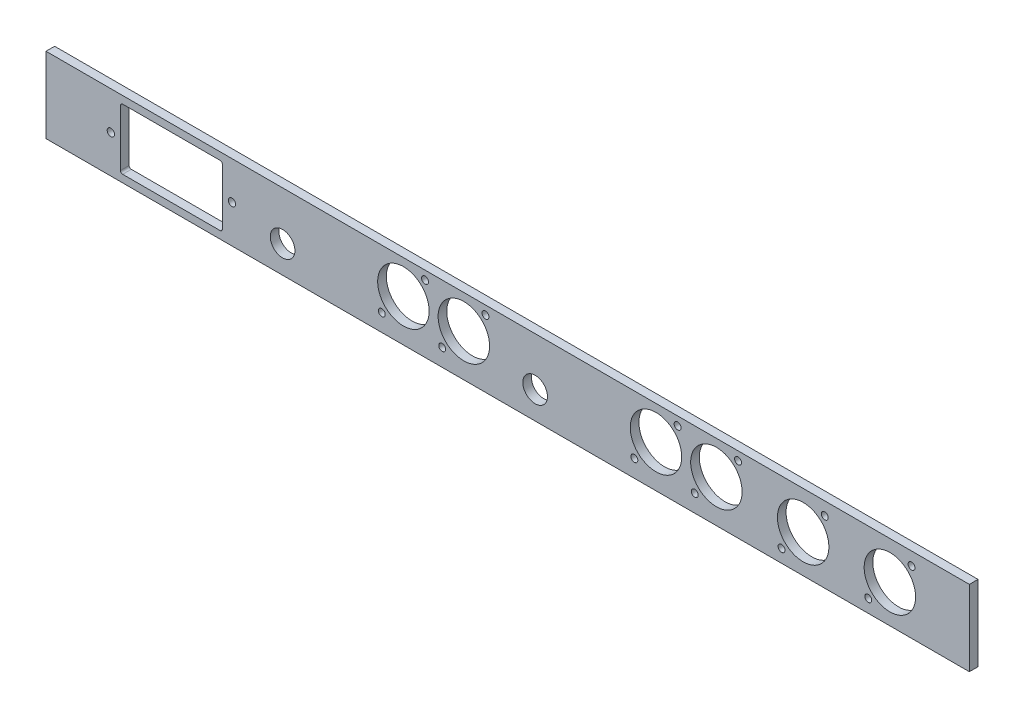
ISO-10303-21;
HEADER;
FILE_DESCRIPTION(('STEP AP214'),'2;1');
FILE_NAME('part.step','',(''),(''),'','','');
FILE_SCHEMA(('AUTOMOTIVE_DESIGN { 1 0 10303 214 1 1 1 1 }'));
ENDSEC;
DATA;
#1=APPLICATION_CONTEXT('core data for automotive mechanical design processes');
#2=APPLICATION_PROTOCOL_DEFINITION('international standard','automotive_design',2000,#1);
#3=PRODUCT_CONTEXT('',#1,'mechanical');
#4=PRODUCT('Part','Part','',(#3));
#5=PRODUCT_RELATED_PRODUCT_CATEGORY('part','',(#4));
#6=PRODUCT_DEFINITION_FORMATION('','',#4);
#7=PRODUCT_DEFINITION_CONTEXT('part definition',#1,'design');
#8=PRODUCT_DEFINITION('design','',#6,#7);
#9=PRODUCT_DEFINITION_SHAPE('','',#8);
#10=(LENGTH_UNIT() NAMED_UNIT(*) SI_UNIT(.MILLI.,.METRE.));
#11=(NAMED_UNIT(*) PLANE_ANGLE_UNIT() SI_UNIT($,.RADIAN.));
#12=(NAMED_UNIT(*) SI_UNIT($,.STERADIAN.) SOLID_ANGLE_UNIT());
#13=UNCERTAINTY_MEASURE_WITH_UNIT(LENGTH_MEASURE(1.E-05),#10,'distance_accuracy_value','');
#14=(GEOMETRIC_REPRESENTATION_CONTEXT(3) GLOBAL_UNCERTAINTY_ASSIGNED_CONTEXT((#13)) GLOBAL_UNIT_ASSIGNED_CONTEXT((#10,
#11,#12)) REPRESENTATION_CONTEXT('',''));
#15=CARTESIAN_POINT('',(0.,0.,0.));
#16=DIRECTION('',(0.,0.,1.));
#17=DIRECTION('',(1.,0.,0.));
#18=AXIS2_PLACEMENT_3D('',#15,#16,#17);
#19=CARTESIAN_POINT('',(-213.5,-17.5,4.));
#20=DIRECTION('',(1.,0.,0.));
#21=DIRECTION('',(0.,0.,-1.));
#22=AXIS2_PLACEMENT_3D('',#19,#20,#21);
#23=PLANE('',#22);
#24=DIRECTION('',(0.,-1.,0.));
#25=VECTOR('',#24,1.);
#26=CARTESIAN_POINT('',(-213.5,-17.5,0.));
#27=LINE('',#26,#25);
#28=CARTESIAN_POINT('',(-213.5,17.5,0.));
#29=VERTEX_POINT('',#28);
#30=CARTESIAN_POINT('',(-213.5,-17.5,0.));
#31=VERTEX_POINT('',#30);
#32=EDGE_CURVE('E294',#29,#31,#27,.T.);
#33=ORIENTED_EDGE('',*,*,#32,.T.);
#34=DIRECTION('',(0.,0.,-1.));
#35=VECTOR('',#34,1.);
#36=CARTESIAN_POINT('',(-213.5,-17.5,4.));
#37=LINE('',#36,#35);
#38=CARTESIAN_POINT('',(-213.5,-17.5,4.));
#39=VERTEX_POINT('',#38);
#40=EDGE_CURVE('E11',#39,#31,#37,.T.);
#41=ORIENTED_EDGE('',*,*,#40,.F.);
#42=DIRECTION('',(0.,-1.,0.));
#43=VECTOR('',#42,1.);
#44=CARTESIAN_POINT('',(-213.5,-17.5,4.));
#45=LINE('',#44,#43);
#46=CARTESIAN_POINT('',(-213.5,17.5,4.));
#47=VERTEX_POINT('',#46);
#48=EDGE_CURVE('E297',#47,#39,#45,.T.);
#49=ORIENTED_EDGE('',*,*,#48,.F.);
#50=DIRECTION('',(0.,0.,-1.));
#51=VECTOR('',#50,1.);
#52=CARTESIAN_POINT('',(-213.5,17.5,4.));
#53=LINE('',#52,#51);
#54=EDGE_CURVE('E307',#47,#29,#53,.T.);
#55=ORIENTED_EDGE('',*,*,#54,.T.);
#56=EDGE_LOOP('',(#33,#41,#49,#55));
#57=FACE_BOUND('',#56,.T.);
#58=ADVANCED_FACE('F38',(#57),#23,.F.);
#59=CARTESIAN_POINT('',(-213.5,-17.5,4.));
#60=DIRECTION('',(0.,1.,0.));
#61=DIRECTION('',(0.,0.,1.));
#62=AXIS2_PLACEMENT_3D('',#59,#60,#61);
#63=PLANE('',#62);
#64=DIRECTION('',(1.,0.,0.));
#65=VECTOR('',#64,1.);
#66=CARTESIAN_POINT('',(-213.5,-17.5,0.));
#67=LINE('',#66,#65);
#68=CARTESIAN_POINT('',(213.5,-17.5,0.));
#69=VERTEX_POINT('',#68);
#70=EDGE_CURVE('E310',#31,#69,#67,.T.);
#71=ORIENTED_EDGE('',*,*,#70,.T.);
#72=DIRECTION('',(0.,0.,-1.));
#73=VECTOR('',#72,1.);
#74=CARTESIAN_POINT('',(213.5,-17.5,4.));
#75=LINE('',#74,#73);
#76=CARTESIAN_POINT('',(213.5,-17.5,4.));
#77=VERTEX_POINT('',#76);
#78=EDGE_CURVE('E45',#77,#69,#75,.T.);
#79=ORIENTED_EDGE('',*,*,#78,.F.);
#80=DIRECTION('',(1.,0.,0.));
#81=VECTOR('',#80,1.);
#82=CARTESIAN_POINT('',(-213.5,-17.5,4.));
#83=LINE('',#82,#81);
#84=EDGE_CURVE('E300',#39,#77,#83,.T.);
#85=ORIENTED_EDGE('',*,*,#84,.F.);
#86=ORIENTED_EDGE('',*,*,#40,.T.);
#87=EDGE_LOOP('',(#71,#79,#85,#86));
#88=FACE_BOUND('',#87,.T.);
#89=ADVANCED_FACE('F339',(#88),#63,.F.);
#90=CARTESIAN_POINT('',(213.5,-17.5,4.));
#91=DIRECTION('',(-1.,0.,0.));
#92=DIRECTION('',(0.,0.,1.));
#93=AXIS2_PLACEMENT_3D('',#90,#91,#92);
#94=PLANE('',#93);
#95=DIRECTION('',(0.,1.,0.));
#96=VECTOR('',#95,1.);
#97=CARTESIAN_POINT('',(213.5,-17.5,0.));
#98=LINE('',#97,#96);
#99=CARTESIAN_POINT('',(213.5,17.5,0.));
#100=VERTEX_POINT('',#99);
#101=EDGE_CURVE('E312',#69,#100,#98,.T.);
#102=ORIENTED_EDGE('',*,*,#101,.T.);
#103=DIRECTION('',(0.,0.,-1.));
#104=VECTOR('',#103,1.);
#105=CARTESIAN_POINT('',(213.5,17.5,4.));
#106=LINE('',#105,#104);
#107=CARTESIAN_POINT('',(213.5,17.5,4.));
#108=VERTEX_POINT('',#107);
#109=EDGE_CURVE('E317',#108,#100,#106,.T.);
#110=ORIENTED_EDGE('',*,*,#109,.F.);
#111=DIRECTION('',(0.,1.,0.));
#112=VECTOR('',#111,1.);
#113=CARTESIAN_POINT('',(213.5,-17.5,4.));
#114=LINE('',#113,#112);
#115=EDGE_CURVE('E303',#77,#108,#114,.T.);
#116=ORIENTED_EDGE('',*,*,#115,.F.);
#117=ORIENTED_EDGE('',*,*,#78,.T.);
#118=EDGE_LOOP('',(#102,#110,#116,#117));
#119=FACE_BOUND('',#118,.T.);
#120=ADVANCED_FACE('F324',(#119),#94,.F.);
#121=CARTESIAN_POINT('',(-213.5,17.5,4.));
#122=DIRECTION('',(0.,-1.,0.));
#123=DIRECTION('',(0.,0.,-1.));
#124=AXIS2_PLACEMENT_3D('',#121,#122,#123);
#125=PLANE('',#124);
#126=DIRECTION('',(-1.,0.,0.));
#127=VECTOR('',#126,1.);
#128=CARTESIAN_POINT('',(-213.5,17.5,0.));
#129=LINE('',#128,#127);
#130=EDGE_CURVE('E301',#100,#29,#129,.T.);
#131=ORIENTED_EDGE('',*,*,#130,.T.);
#132=ORIENTED_EDGE('',*,*,#54,.F.);
#133=DIRECTION('',(-1.,0.,0.));
#134=VECTOR('',#133,1.);
#135=CARTESIAN_POINT('',(-213.5,17.5,4.));
#136=LINE('',#135,#134);
#137=EDGE_CURVE('E305',#108,#47,#136,.T.);
#138=ORIENTED_EDGE('',*,*,#137,.F.);
#139=ORIENTED_EDGE('',*,*,#109,.T.);
#140=EDGE_LOOP('',(#131,#132,#138,#139));
#141=FACE_BOUND('',#140,.T.);
#142=ADVANCED_FACE('F332',(#141),#125,.F.);
#143=CARTESIAN_POINT('',(0.,0.,4.));
#144=DIRECTION('',(0.,0.,-1.));
#145=DIRECTION('',(-1.,0.,0.));
#146=AXIS2_PLACEMENT_3D('',#143,#144,#145);
#147=PLANE('',#146);
#148=CARTESIAN_POINT('',(-127.5,0.,4.));
#149=DIRECTION('',(0.,0.,1.));
#150=DIRECTION('',(-1.,0.,0.));
#151=AXIS2_PLACEMENT_3D('',#148,#149,#150);
#152=CIRCLE('',#151,1.69999999999717);
#153=CARTESIAN_POINT('',(-129.199999999997,0.,4.));
#154=VERTEX_POINT('',#153);
#155=EDGE_CURVE('E201',#154,#154,#152,.T.);
#156=ORIENTED_EDGE('',*,*,#155,.F.);
#157=EDGE_LOOP('',(#156));
#158=FACE_BOUND('',#157,.T.);
#159=DIRECTION('',(1.,0.,0.));
#160=VECTOR('',#159,1.);
#161=CARTESIAN_POINT('',(-178.05,-14.05,4.));
#162=LINE('',#161,#160);
#163=CARTESIAN_POINT('',(-178.05,-14.05,4.));
#164=VERTEX_POINT('',#163);
#165=CARTESIAN_POINT('',(-132.95,-14.05,4.));
#166=VERTEX_POINT('',#165);
#167=EDGE_CURVE('E169',#164,#166,#162,.T.);
#168=ORIENTED_EDGE('',*,*,#167,.F.);
#169=CARTESIAN_POINT('',(-178.05,-13.05,4.));
#170=DIRECTION('',(0.,0.,1.));
#171=DIRECTION('',(-1.,0.,0.));
#172=AXIS2_PLACEMENT_3D('',#169,#170,#171);
#173=CIRCLE('',#172,1.);
#174=CARTESIAN_POINT('',(-179.05,-13.05,4.));
#175=VERTEX_POINT('',#174);
#176=EDGE_CURVE('E52',#175,#164,#173,.T.);
#177=ORIENTED_EDGE('',*,*,#176,.F.);
#178=DIRECTION('',(0.,-1.,0.));
#179=VECTOR('',#178,1.);
#180=CARTESIAN_POINT('',(-179.05,-13.05,4.));
#181=LINE('',#180,#179);
#182=CARTESIAN_POINT('',(-179.05,13.05,4.));
#183=VERTEX_POINT('',#182);
#184=EDGE_CURVE('E145',#183,#175,#181,.T.);
#185=ORIENTED_EDGE('',*,*,#184,.F.);
#186=CARTESIAN_POINT('',(-178.05,13.05,4.));
#187=DIRECTION('',(0.,0.,1.));
#188=DIRECTION('',(-1.,0.,0.));
#189=AXIS2_PLACEMENT_3D('',#186,#187,#188);
#190=CIRCLE('',#189,1.);
#191=CARTESIAN_POINT('',(-178.05,14.05,4.));
#192=VERTEX_POINT('',#191);
#193=EDGE_CURVE('E148',#192,#183,#190,.T.);
#194=ORIENTED_EDGE('',*,*,#193,.F.);
#195=DIRECTION('',(-1.,0.,0.));
#196=VECTOR('',#195,1.);
#197=CARTESIAN_POINT('',(-178.05,14.05,4.));
#198=LINE('',#197,#196);
#199=CARTESIAN_POINT('',(-132.95,14.05,4.));
#200=VERTEX_POINT('',#199);
#201=EDGE_CURVE('E181',#200,#192,#198,.T.);
#202=ORIENTED_EDGE('',*,*,#201,.F.);
#203=CARTESIAN_POINT('',(-132.95,13.05,4.));
#204=DIRECTION('',(0.,0.,1.));
#205=DIRECTION('',(1.,0.,0.));
#206=AXIS2_PLACEMENT_3D('',#203,#204,#205);
#207=CIRCLE('',#206,1.);
#208=CARTESIAN_POINT('',(-131.95,13.05,4.));
#209=VERTEX_POINT('',#208);
#210=EDGE_CURVE('E178',#209,#200,#207,.T.);
#211=ORIENTED_EDGE('',*,*,#210,.F.);
#212=DIRECTION('',(0.,1.,0.));
#213=VECTOR('',#212,1.);
#214=CARTESIAN_POINT('',(-131.95,-13.05,4.));
#215=LINE('',#214,#213);
#216=CARTESIAN_POINT('',(-131.95,-13.05,4.));
#217=VERTEX_POINT('',#216);
#218=EDGE_CURVE('E175',#217,#209,#215,.T.);
#219=ORIENTED_EDGE('',*,*,#218,.F.);
#220=CARTESIAN_POINT('',(-132.95,-13.05,4.));
#221=DIRECTION('',(0.,0.,1.));
#222=DIRECTION('',(-1.,0.,0.));
#223=AXIS2_PLACEMENT_3D('',#220,#221,#222);
#224=CIRCLE('',#223,1.);
#225=EDGE_CURVE('E172',#166,#217,#224,.T.);
#226=ORIENTED_EDGE('',*,*,#225,.F.);
#227=EDGE_LOOP('',(#168,#177,#185,#194,#202,#211,#219,#226));
#228=FACE_BOUND('',#227,.T.);
#229=CARTESIAN_POINT('',(136.64,0.,4.));
#230=DIRECTION('',(0.,0.,1.));
#231=DIRECTION('',(1.,0.,0.));
#232=AXIS2_PLACEMENT_3D('',#229,#230,#231);
#233=CIRCLE('',#232,11.9);
#234=CARTESIAN_POINT('',(148.54,0.,4.));
#235=VERTEX_POINT('',#234);
#236=EDGE_CURVE('E151',#235,#235,#233,.T.);
#237=ORIENTED_EDGE('',*,*,#236,.F.);
#238=EDGE_LOOP('',(#237));
#239=FACE_BOUND('',#238,.T.);
#240=CARTESIAN_POINT('',(12.7,-4.86500000000029,4.));
#241=DIRECTION('',(0.,0.,1.));
#242=DIRECTION('',(1.,0.,0.));
#243=AXIS2_PLACEMENT_3D('',#240,#241,#242);
#244=CIRCLE('',#243,5.70000000000001);
#245=CARTESIAN_POINT('',(18.4,-4.86500000000029,4.));
#246=VERTEX_POINT('',#245);
#247=EDGE_CURVE('E216',#246,#246,#244,.T.);
#248=ORIENTED_EDGE('',*,*,#247,.F.);
#249=EDGE_LOOP('',(#248));
#250=FACE_BOUND('',#249,.T.);
#251=CARTESIAN_POINT('',(78.58,13.5,4.));
#252=DIRECTION('',(0.,0.,1.));
#253=DIRECTION('',(1.,0.,0.));
#254=AXIS2_PLACEMENT_3D('',#251,#252,#253);
#255=CIRCLE('',#254,1.60000000000002);
#256=CARTESIAN_POINT('',(80.18,13.5,4.));
#257=VERTEX_POINT('',#256);
#258=EDGE_CURVE('E209',#257,#257,#255,.T.);
#259=ORIENTED_EDGE('',*,*,#258,.F.);
#260=EDGE_LOOP('',(#259));
#261=FACE_BOUND('',#260,.T.);
#262=CARTESIAN_POINT('',(-183.5,4.80539157517431E-13,4.));
#263=DIRECTION('',(0.,0.,1.));
#264=DIRECTION('',(1.,0.,0.));
#265=AXIS2_PLACEMENT_3D('',#262,#263,#264);
#266=CIRCLE('',#265,1.69999999999983);
#267=CARTESIAN_POINT('',(-181.8,4.80539157517431E-13,4.));
#268=VERTEX_POINT('',#267);
#269=EDGE_CURVE('E476',#268,#268,#266,.T.);
#270=ORIENTED_EDGE('',*,*,#269,.F.);
#271=EDGE_LOOP('',(#270));
#272=FACE_BOUND('',#271,.T.);
#273=CARTESIAN_POINT('',(126.64,-11.5,4.));
#274=DIRECTION('',(0.,0.,1.));
#275=DIRECTION('',(1.,0.,0.));
#276=AXIS2_PLACEMENT_3D('',#273,#274,#275);
#277=CIRCLE('',#276,1.59999999999999);
#278=CARTESIAN_POINT('',(128.24,-11.5,4.));
#279=VERTEX_POINT('',#278);
#280=EDGE_CURVE('E482',#279,#279,#277,.T.);
#281=ORIENTED_EDGE('',*,*,#280,.F.);
#282=EDGE_LOOP('',(#281));
#283=FACE_BOUND('',#282,.T.);
#284=CARTESIAN_POINT('',(146.64,11.5,4.));
#285=DIRECTION('',(0.,0.,1.));
#286=DIRECTION('',(1.,0.,0.));
#287=AXIS2_PLACEMENT_3D('',#284,#285,#286);
#288=CIRCLE('',#287,1.60000000000005);
#289=CARTESIAN_POINT('',(148.24,11.5,4.));
#290=VERTEX_POINT('',#289);
#291=EDGE_CURVE('E490',#290,#290,#288,.T.);
#292=ORIENTED_EDGE('',*,*,#291,.F.);
#293=EDGE_LOOP('',(#292));
#294=FACE_BOUND('',#293,.T.);
#295=CARTESIAN_POINT('',(186.76,11.5,4.));
#296=DIRECTION('',(0.,0.,1.));
#297=DIRECTION('',(1.,0.,0.));
#298=AXIS2_PLACEMENT_3D('',#295,#296,#297);
#299=CIRCLE('',#298,1.60000000000002);
#300=CARTESIAN_POINT('',(188.36,11.5,4.));
#301=VERTEX_POINT('',#300);
#302=EDGE_CURVE('E504',#301,#301,#299,.T.);
#303=ORIENTED_EDGE('',*,*,#302,.F.);
#304=EDGE_LOOP('',(#303));
#305=FACE_BOUND('',#304,.T.);
#306=CARTESIAN_POINT('',(166.76,-11.5,4.));
#307=DIRECTION('',(0.,0.,1.));
#308=DIRECTION('',(1.,0.,0.));
#309=AXIS2_PLACEMENT_3D('',#306,#307,#308);
#310=CIRCLE('',#309,1.59999999999996);
#311=CARTESIAN_POINT('',(168.36,-11.5,4.));
#312=VERTEX_POINT('',#311);
#313=EDGE_CURVE('E498',#312,#312,#310,.T.);
#314=ORIENTED_EDGE('',*,*,#313,.F.);
#315=EDGE_LOOP('',(#314));
#316=FACE_BOUND('',#315,.T.);
#317=CARTESIAN_POINT('',(176.76,0.,4.));
#318=DIRECTION('',(0.,0.,1.));
#319=DIRECTION('',(1.,0.,0.));
#320=AXIS2_PLACEMENT_3D('',#317,#318,#319);
#321=CIRCLE('',#320,11.9);
#322=CARTESIAN_POINT('',(188.66,0.,4.));
#323=VERTEX_POINT('',#322);
#324=EDGE_CURVE('E497',#323,#323,#321,.T.);
#325=ORIENTED_EDGE('',*,*,#324,.F.);
#326=EDGE_LOOP('',(#325));
#327=FACE_BOUND('',#326,.T.);
#328=CARTESIAN_POINT('',(-30.2718039359028,-9.49999999999999,4.));
#329=DIRECTION('',(0.,0.,1.));
#330=DIRECTION('',(1.,0.,0.));
#331=AXIS2_PLACEMENT_3D('',#328,#329,#330);
#332=CIRCLE('',#331,1.59999999999982);
#333=CARTESIAN_POINT('',(-28.6718039359029,-9.49999999999999,4.));
#334=VERTEX_POINT('',#333);
#335=EDGE_CURVE('E263',#334,#334,#332,.T.);
#336=ORIENTED_EDGE('',*,*,#335,.F.);
#337=EDGE_LOOP('',(#336));
#338=FACE_BOUND('',#337,.T.);
#339=CARTESIAN_POINT('',(-10.2718039359028,13.5,4.));
#340=DIRECTION('',(0.,0.,1.));
#341=DIRECTION('',(1.,0.,0.));
#342=AXIS2_PLACEMENT_3D('',#339,#340,#341);
#343=CIRCLE('',#342,1.6);
#344=CARTESIAN_POINT('',(-8.67180393590279,13.5,4.));
#345=VERTEX_POINT('',#344);
#346=EDGE_CURVE('E269',#345,#345,#343,.T.);
#347=ORIENTED_EDGE('',*,*,#346,.F.);
#348=EDGE_LOOP('',(#347));
#349=FACE_BOUND('',#348,.T.);
#350=CARTESIAN_POINT('',(-38.2118039359028,13.5,4.));
#351=DIRECTION('',(0.,0.,1.));
#352=DIRECTION('',(1.,0.,0.));
#353=AXIS2_PLACEMENT_3D('',#350,#351,#352);
#354=CIRCLE('',#353,1.6);
#355=CARTESIAN_POINT('',(-36.6118039359028,13.5,4.));
#356=VERTEX_POINT('',#355);
#357=EDGE_CURVE('E243',#356,#356,#354,.T.);
#358=ORIENTED_EDGE('',*,*,#357,.F.);
#359=EDGE_LOOP('',(#358));
#360=FACE_BOUND('',#359,.T.);
#361=CARTESIAN_POINT('',(-58.2118039359028,-9.5,4.));
#362=DIRECTION('',(0.,0.,1.));
#363=DIRECTION('',(1.,0.,0.));
#364=AXIS2_PLACEMENT_3D('',#361,#362,#363);
#365=CIRCLE('',#364,1.59999999999995);
#366=CARTESIAN_POINT('',(-56.6118039359028,-9.5,4.));
#367=VERTEX_POINT('',#366);
#368=EDGE_CURVE('E277',#367,#367,#365,.T.);
#369=ORIENTED_EDGE('',*,*,#368,.F.);
#370=EDGE_LOOP('',(#369));
#371=FACE_BOUND('',#370,.T.);
#372=CARTESIAN_POINT('',(-48.2118039359028,1.99999999999997,4.));
#373=DIRECTION('',(0.,0.,1.));
#374=DIRECTION('',(1.,0.,0.));
#375=AXIS2_PLACEMENT_3D('',#372,#373,#374);
#376=CIRCLE('',#375,11.9);
#377=CARTESIAN_POINT('',(-36.3118039359028,1.99999999999997,4.));
#378=VERTEX_POINT('',#377);
#379=EDGE_CURVE('E276',#378,#378,#376,.T.);
#380=ORIENTED_EDGE('',*,*,#379,.F.);
#381=EDGE_LOOP('',(#380));
#382=FACE_BOUND('',#381,.T.);
#383=CARTESIAN_POINT('',(68.58,2.00000000000003,4.));
#384=DIRECTION('',(0.,0.,1.));
#385=DIRECTION('',(1.,0.,0.));
#386=AXIS2_PLACEMENT_3D('',#383,#384,#385);
#387=CIRCLE('',#386,11.9);
#388=CARTESIAN_POINT('',(80.48,2.00000000000003,4.));
#389=VERTEX_POINT('',#388);
#390=EDGE_CURVE('E231',#389,#389,#387,.T.);
#391=ORIENTED_EDGE('',*,*,#390,.F.);
#392=EDGE_LOOP('',(#391));
#393=FACE_BOUND('',#392,.T.);
#394=CARTESIAN_POINT('',(58.58,-9.49999999999997,4.));
#395=DIRECTION('',(0.,0.,1.));
#396=DIRECTION('',(1.,0.,0.));
#397=AXIS2_PLACEMENT_3D('',#394,#395,#396);
#398=CIRCLE('',#397,1.60000000000002);
#399=CARTESIAN_POINT('',(60.18,-9.49999999999997,4.));
#400=VERTEX_POINT('',#399);
#401=EDGE_CURVE('E208',#400,#400,#398,.T.);
#402=ORIENTED_EDGE('',*,*,#401,.F.);
#403=EDGE_LOOP('',(#402));
#404=FACE_BOUND('',#403,.T.);
#405=CARTESIAN_POINT('',(106.52,13.5,4.));
#406=DIRECTION('',(0.,0.,1.));
#407=DIRECTION('',(1.,0.,0.));
#408=AXIS2_PLACEMENT_3D('',#405,#406,#407);
#409=CIRCLE('',#408,1.60000000000002);
#410=CARTESIAN_POINT('',(108.12,13.5,4.));
#411=VERTEX_POINT('',#410);
#412=EDGE_CURVE('E224',#411,#411,#409,.T.);
#413=ORIENTED_EDGE('',*,*,#412,.F.);
#414=EDGE_LOOP('',(#413));
#415=FACE_BOUND('',#414,.T.);
#416=CARTESIAN_POINT('',(96.52,2.,4.));
#417=DIRECTION('',(0.,0.,1.));
#418=DIRECTION('',(1.,0.,0.));
#419=AXIS2_PLACEMENT_3D('',#416,#417,#418);
#420=CIRCLE('',#419,11.9);
#421=CARTESIAN_POINT('',(108.42,2.,4.));
#422=VERTEX_POINT('',#421);
#423=EDGE_CURVE('E251',#422,#422,#420,.T.);
#424=ORIENTED_EDGE('',*,*,#423,.F.);
#425=EDGE_LOOP('',(#424));
#426=FACE_BOUND('',#425,.T.);
#427=CARTESIAN_POINT('',(86.52,-9.5,4.));
#428=DIRECTION('',(0.,0.,1.));
#429=DIRECTION('',(1.,0.,0.));
#430=AXIS2_PLACEMENT_3D('',#427,#428,#429);
#431=CIRCLE('',#430,1.59999999999996);
#432=CARTESIAN_POINT('',(88.12,-9.5,4.));
#433=VERTEX_POINT('',#432);
#434=EDGE_CURVE('E223',#433,#433,#431,.T.);
#435=ORIENTED_EDGE('',*,*,#434,.F.);
#436=EDGE_LOOP('',(#435));
#437=FACE_BOUND('',#436,.T.);
#438=CARTESIAN_POINT('',(-104.091803935903,-4.86500000000013,4.));
#439=DIRECTION('',(0.,0.,1.));
#440=DIRECTION('',(1.,0.,0.));
#441=AXIS2_PLACEMENT_3D('',#438,#439,#440);
#442=CIRCLE('',#441,5.69999999999999);
#443=CARTESIAN_POINT('',(-98.3918039359028,-4.86500000000013,4.));
#444=VERTEX_POINT('',#443);
#445=EDGE_CURVE('E244',#444,#444,#442,.T.);
#446=ORIENTED_EDGE('',*,*,#445,.F.);
#447=EDGE_LOOP('',(#446));
#448=FACE_BOUND('',#447,.T.);
#449=CARTESIAN_POINT('',(-20.2718039359028,2.00000000000001,4.));
#450=DIRECTION('',(0.,0.,1.));
#451=DIRECTION('',(1.,0.,0.));
#452=AXIS2_PLACEMENT_3D('',#449,#450,#451);
#453=CIRCLE('',#452,11.9);
#454=CARTESIAN_POINT('',(-8.37180393590277,2.00000000000001,4.));
#455=VERTEX_POINT('',#454);
#456=EDGE_CURVE('E262',#455,#455,#453,.T.);
#457=ORIENTED_EDGE('',*,*,#456,.F.);
#458=EDGE_LOOP('',(#457));
#459=FACE_BOUND('',#458,.T.);
#460=ORIENTED_EDGE('',*,*,#48,.T.);
#461=ORIENTED_EDGE('',*,*,#84,.T.);
#462=ORIENTED_EDGE('',*,*,#115,.T.);
#463=ORIENTED_EDGE('',*,*,#137,.T.);
#464=EDGE_LOOP('',(#460,#461,#462,#463));
#465=FACE_BOUND('',#464,.T.);
#466=ADVANCED_FACE('F338',(#158,#228,#239,#250,#261,#272,#283,#294,#305,#316,#327,#338,#349,
#360,#371,#382,#393,#404,#415,#426,#437,#448,#459,#465),#147,.F.);
#467=CARTESIAN_POINT('',(0.,0.,0.));
#468=DIRECTION('',(0.,0.,-1.));
#469=DIRECTION('',(-1.,0.,0.));
#470=AXIS2_PLACEMENT_3D('',#467,#468,#469);
#471=PLANE('',#470);
#472=CARTESIAN_POINT('',(-127.5,0.,0.));
#473=DIRECTION('',(0.,0.,1.));
#474=DIRECTION('',(-1.,0.,0.));
#475=AXIS2_PLACEMENT_3D('',#472,#473,#474);
#476=CIRCLE('',#475,1.69999999999717);
#477=CARTESIAN_POINT('',(-129.199999999997,0.,0.));
#478=VERTEX_POINT('',#477);
#479=EDGE_CURVE('E170',#478,#478,#476,.T.);
#480=ORIENTED_EDGE('',*,*,#479,.T.);
#481=EDGE_LOOP('',(#480));
#482=FACE_BOUND('',#481,.T.);
#483=CARTESIAN_POINT('',(-178.05,-13.05,0.));
#484=DIRECTION('',(0.,0.,1.));
#485=DIRECTION('',(-1.,0.,0.));
#486=AXIS2_PLACEMENT_3D('',#483,#484,#485);
#487=CIRCLE('',#486,1.);
#488=CARTESIAN_POINT('',(-179.05,-13.05,0.));
#489=VERTEX_POINT('',#488);
#490=CARTESIAN_POINT('',(-178.05,-14.05,0.));
#491=VERTEX_POINT('',#490);
#492=EDGE_CURVE('E128',#489,#491,#487,.T.);
#493=ORIENTED_EDGE('',*,*,#492,.T.);
#494=DIRECTION('',(1.,0.,0.));
#495=VECTOR('',#494,1.);
#496=CARTESIAN_POINT('',(-178.05,-14.05,0.));
#497=LINE('',#496,#495);
#498=CARTESIAN_POINT('',(-132.95,-14.05,0.));
#499=VERTEX_POINT('',#498);
#500=EDGE_CURVE('E137',#491,#499,#497,.T.);
#501=ORIENTED_EDGE('',*,*,#500,.T.);
#502=CARTESIAN_POINT('',(-132.95,-13.05,0.));
#503=DIRECTION('',(0.,0.,1.));
#504=DIRECTION('',(-1.,0.,0.));
#505=AXIS2_PLACEMENT_3D('',#502,#503,#504);
#506=CIRCLE('',#505,1.);
#507=CARTESIAN_POINT('',(-131.95,-13.05,0.));
#508=VERTEX_POINT('',#507);
#509=EDGE_CURVE('E60',#499,#508,#506,.T.);
#510=ORIENTED_EDGE('',*,*,#509,.T.);
#511=DIRECTION('',(0.,1.,0.));
#512=VECTOR('',#511,1.);
#513=CARTESIAN_POINT('',(-131.95,-13.05,0.));
#514=LINE('',#513,#512);
#515=CARTESIAN_POINT('',(-131.95,13.05,0.));
#516=VERTEX_POINT('',#515);
#517=EDGE_CURVE('E155',#508,#516,#514,.T.);
#518=ORIENTED_EDGE('',*,*,#517,.T.);
#519=CARTESIAN_POINT('',(-132.95,13.05,0.));
#520=DIRECTION('',(0.,0.,1.));
#521=DIRECTION('',(1.,0.,0.));
#522=AXIS2_PLACEMENT_3D('',#519,#520,#521);
#523=CIRCLE('',#522,1.);
#524=CARTESIAN_POINT('',(-132.95,14.05,0.));
#525=VERTEX_POINT('',#524);
#526=EDGE_CURVE('E158',#516,#525,#523,.T.);
#527=ORIENTED_EDGE('',*,*,#526,.T.);
#528=DIRECTION('',(-1.,0.,0.));
#529=VECTOR('',#528,1.);
#530=CARTESIAN_POINT('',(-178.05,14.05,0.));
#531=LINE('',#530,#529);
#532=CARTESIAN_POINT('',(-178.05,14.05,0.));
#533=VERTEX_POINT('',#532);
#534=EDGE_CURVE('E161',#525,#533,#531,.T.);
#535=ORIENTED_EDGE('',*,*,#534,.T.);
#536=CARTESIAN_POINT('',(-178.05,13.05,0.));
#537=DIRECTION('',(0.,0.,1.));
#538=DIRECTION('',(-1.,0.,0.));
#539=AXIS2_PLACEMENT_3D('',#536,#537,#538);
#540=CIRCLE('',#539,1.);
#541=CARTESIAN_POINT('',(-179.05,13.05,0.));
#542=VERTEX_POINT('',#541);
#543=EDGE_CURVE('E165',#533,#542,#540,.T.);
#544=ORIENTED_EDGE('',*,*,#543,.T.);
#545=DIRECTION('',(0.,-1.,0.));
#546=VECTOR('',#545,1.);
#547=CARTESIAN_POINT('',(-179.05,-13.05,0.));
#548=LINE('',#547,#546);
#549=EDGE_CURVE('E134',#542,#489,#548,.T.);
#550=ORIENTED_EDGE('',*,*,#549,.T.);
#551=EDGE_LOOP('',(#493,#501,#510,#518,#527,#535,#544,#550));
#552=FACE_BOUND('',#551,.T.);
#553=CARTESIAN_POINT('',(136.64,0.,0.));
#554=DIRECTION('',(0.,0.,1.));
#555=DIRECTION('',(1.,0.,0.));
#556=AXIS2_PLACEMENT_3D('',#553,#554,#555);
#557=CIRCLE('',#556,11.9);
#558=CARTESIAN_POINT('',(148.54,0.,0.));
#559=VERTEX_POINT('',#558);
#560=EDGE_CURVE('E219',#559,#559,#557,.T.);
#561=ORIENTED_EDGE('',*,*,#560,.T.);
#562=EDGE_LOOP('',(#561));
#563=FACE_BOUND('',#562,.T.);
#564=CARTESIAN_POINT('',(12.7,-4.86500000000029,0.));
#565=DIRECTION('',(0.,0.,1.));
#566=DIRECTION('',(1.,0.,0.));
#567=AXIS2_PLACEMENT_3D('',#564,#565,#566);
#568=CIRCLE('',#567,5.70000000000001);
#569=CARTESIAN_POINT('',(18.4,-4.86500000000029,0.));
#570=VERTEX_POINT('',#569);
#571=EDGE_CURVE('E212',#570,#570,#568,.T.);
#572=ORIENTED_EDGE('',*,*,#571,.T.);
#573=EDGE_LOOP('',(#572));
#574=FACE_BOUND('',#573,.T.);
#575=CARTESIAN_POINT('',(78.58,13.5,0.));
#576=DIRECTION('',(0.,0.,1.));
#577=DIRECTION('',(1.,0.,0.));
#578=AXIS2_PLACEMENT_3D('',#575,#576,#577);
#579=CIRCLE('',#578,1.60000000000002);
#580=CARTESIAN_POINT('',(80.18,13.5,0.));
#581=VERTEX_POINT('',#580);
#582=EDGE_CURVE('E205',#581,#581,#579,.T.);
#583=ORIENTED_EDGE('',*,*,#582,.T.);
#584=EDGE_LOOP('',(#583));
#585=FACE_BOUND('',#584,.T.);
#586=CARTESIAN_POINT('',(-183.5,4.80539157517431E-13,0.));
#587=DIRECTION('',(0.,0.,1.));
#588=DIRECTION('',(1.,0.,0.));
#589=AXIS2_PLACEMENT_3D('',#586,#587,#588);
#590=CIRCLE('',#589,1.69999999999983);
#591=CARTESIAN_POINT('',(-181.8,4.80539157517431E-13,0.));
#592=VERTEX_POINT('',#591);
#593=EDGE_CURVE('E204',#592,#592,#590,.T.);
#594=ORIENTED_EDGE('',*,*,#593,.T.);
#595=EDGE_LOOP('',(#594));
#596=FACE_BOUND('',#595,.T.);
#597=CARTESIAN_POINT('',(126.64,-11.5,0.));
#598=DIRECTION('',(0.,0.,1.));
#599=DIRECTION('',(1.,0.,0.));
#600=AXIS2_PLACEMENT_3D('',#597,#598,#599);
#601=CIRCLE('',#600,1.59999999999999);
#602=CARTESIAN_POINT('',(128.24,-11.5,0.));
#603=VERTEX_POINT('',#602);
#604=EDGE_CURVE('E478',#603,#603,#601,.T.);
#605=ORIENTED_EDGE('',*,*,#604,.T.);
#606=EDGE_LOOP('',(#605));
#607=FACE_BOUND('',#606,.T.);
#608=CARTESIAN_POINT('',(146.64,11.5,0.));
#609=DIRECTION('',(0.,0.,1.));
#610=DIRECTION('',(1.,0.,0.));
#611=AXIS2_PLACEMENT_3D('',#608,#609,#610);
#612=CIRCLE('',#611,1.60000000000005);
#613=CARTESIAN_POINT('',(148.24,11.5,0.));
#614=VERTEX_POINT('',#613);
#615=EDGE_CURVE('E487',#614,#614,#612,.T.);
#616=ORIENTED_EDGE('',*,*,#615,.T.);
#617=EDGE_LOOP('',(#616));
#618=FACE_BOUND('',#617,.T.);
#619=CARTESIAN_POINT('',(186.76,11.5,0.));
#620=DIRECTION('',(0.,0.,1.));
#621=DIRECTION('',(1.,0.,0.));
#622=AXIS2_PLACEMENT_3D('',#619,#620,#621);
#623=CIRCLE('',#622,1.60000000000002);
#624=CARTESIAN_POINT('',(188.36,11.5,0.));
#625=VERTEX_POINT('',#624);
#626=EDGE_CURVE('E501',#625,#625,#623,.T.);
#627=ORIENTED_EDGE('',*,*,#626,.T.);
#628=EDGE_LOOP('',(#627));
#629=FACE_BOUND('',#628,.T.);
#630=CARTESIAN_POINT('',(166.76,-11.5,0.));
#631=DIRECTION('',(0.,0.,1.));
#632=DIRECTION('',(1.,0.,0.));
#633=AXIS2_PLACEMENT_3D('',#630,#631,#632);
#634=CIRCLE('',#633,1.59999999999996);
#635=CARTESIAN_POINT('',(168.36,-11.5,0.));
#636=VERTEX_POINT('',#635);
#637=EDGE_CURVE('E494',#636,#636,#634,.T.);
#638=ORIENTED_EDGE('',*,*,#637,.T.);
#639=EDGE_LOOP('',(#638));
#640=FACE_BOUND('',#639,.T.);
#641=CARTESIAN_POINT('',(176.76,0.,0.));
#642=DIRECTION('',(0.,0.,1.));
#643=DIRECTION('',(1.,0.,0.));
#644=AXIS2_PLACEMENT_3D('',#641,#642,#643);
#645=CIRCLE('',#644,11.9);
#646=CARTESIAN_POINT('',(188.66,0.,0.));
#647=VERTEX_POINT('',#646);
#648=EDGE_CURVE('E493',#647,#647,#645,.T.);
#649=ORIENTED_EDGE('',*,*,#648,.T.);
#650=EDGE_LOOP('',(#649));
#651=FACE_BOUND('',#650,.T.);
#652=CARTESIAN_POINT('',(-30.2718039359028,-9.49999999999999,0.));
#653=DIRECTION('',(0.,0.,1.));
#654=DIRECTION('',(1.,0.,0.));
#655=AXIS2_PLACEMENT_3D('',#652,#653,#654);
#656=CIRCLE('',#655,1.59999999999982);
#657=CARTESIAN_POINT('',(-28.6718039359029,-9.49999999999999,0.));
#658=VERTEX_POINT('',#657);
#659=EDGE_CURVE('E259',#658,#658,#656,.T.);
#660=ORIENTED_EDGE('',*,*,#659,.T.);
#661=EDGE_LOOP('',(#660));
#662=FACE_BOUND('',#661,.T.);
#663=CARTESIAN_POINT('',(-10.2718039359028,13.5,0.));
#664=DIRECTION('',(0.,0.,1.));
#665=DIRECTION('',(1.,0.,0.));
#666=AXIS2_PLACEMENT_3D('',#663,#664,#665);
#667=CIRCLE('',#666,1.6);
#668=CARTESIAN_POINT('',(-8.67180393590279,13.5,0.));
#669=VERTEX_POINT('',#668);
#670=EDGE_CURVE('E266',#669,#669,#667,.T.);
#671=ORIENTED_EDGE('',*,*,#670,.T.);
#672=EDGE_LOOP('',(#671));
#673=FACE_BOUND('',#672,.T.);
#674=CARTESIAN_POINT('',(-38.2118039359028,13.5,0.));
#675=DIRECTION('',(0.,0.,1.));
#676=DIRECTION('',(1.,0.,0.));
#677=AXIS2_PLACEMENT_3D('',#674,#675,#676);
#678=CIRCLE('',#677,1.6);
#679=CARTESIAN_POINT('',(-36.6118039359028,13.5,0.));
#680=VERTEX_POINT('',#679);
#681=EDGE_CURVE('E280',#680,#680,#678,.T.);
#682=ORIENTED_EDGE('',*,*,#681,.T.);
#683=EDGE_LOOP('',(#682));
#684=FACE_BOUND('',#683,.T.);
#685=CARTESIAN_POINT('',(-58.2118039359028,-9.5,0.));
#686=DIRECTION('',(0.,0.,1.));
#687=DIRECTION('',(1.,0.,0.));
#688=AXIS2_PLACEMENT_3D('',#685,#686,#687);
#689=CIRCLE('',#688,1.59999999999995);
#690=CARTESIAN_POINT('',(-56.6118039359028,-9.5,0.));
#691=VERTEX_POINT('',#690);
#692=EDGE_CURVE('E273',#691,#691,#689,.T.);
#693=ORIENTED_EDGE('',*,*,#692,.T.);
#694=EDGE_LOOP('',(#693));
#695=FACE_BOUND('',#694,.T.);
#696=CARTESIAN_POINT('',(-48.2118039359028,1.99999999999997,0.));
#697=DIRECTION('',(0.,0.,1.));
#698=DIRECTION('',(1.,0.,0.));
#699=AXIS2_PLACEMENT_3D('',#696,#697,#698);
#700=CIRCLE('',#699,11.9);
#701=CARTESIAN_POINT('',(-36.3118039359028,1.99999999999997,0.));
#702=VERTEX_POINT('',#701);
#703=EDGE_CURVE('E272',#702,#702,#700,.T.);
#704=ORIENTED_EDGE('',*,*,#703,.T.);
#705=EDGE_LOOP('',(#704));
#706=FACE_BOUND('',#705,.T.);
#707=CARTESIAN_POINT('',(68.58,2.00000000000003,0.));
#708=DIRECTION('',(0.,0.,1.));
#709=DIRECTION('',(1.,0.,0.));
#710=AXIS2_PLACEMENT_3D('',#707,#708,#709);
#711=CIRCLE('',#710,11.9);
#712=CARTESIAN_POINT('',(80.48,2.00000000000003,0.));
#713=VERTEX_POINT('',#712);
#714=EDGE_CURVE('E227',#713,#713,#711,.T.);
#715=ORIENTED_EDGE('',*,*,#714,.T.);
#716=EDGE_LOOP('',(#715));
#717=FACE_BOUND('',#716,.T.);
#718=CARTESIAN_POINT('',(58.58,-9.49999999999997,0.));
#719=DIRECTION('',(0.,0.,1.));
#720=DIRECTION('',(1.,0.,0.));
#721=AXIS2_PLACEMENT_3D('',#718,#719,#720);
#722=CIRCLE('',#721,1.60000000000002);
#723=CARTESIAN_POINT('',(60.18,-9.49999999999997,0.));
#724=VERTEX_POINT('',#723);
#725=EDGE_CURVE('E228',#724,#724,#722,.T.);
#726=ORIENTED_EDGE('',*,*,#725,.T.);
#727=EDGE_LOOP('',(#726));
#728=FACE_BOUND('',#727,.T.);
#729=CARTESIAN_POINT('',(106.52,13.5,0.));
#730=DIRECTION('',(0.,0.,1.));
#731=DIRECTION('',(1.,0.,0.));
#732=AXIS2_PLACEMENT_3D('',#729,#730,#731);
#733=CIRCLE('',#732,1.60000000000002);
#734=CARTESIAN_POINT('',(108.12,13.5,0.));
#735=VERTEX_POINT('',#734);
#736=EDGE_CURVE('E220',#735,#735,#733,.T.);
#737=ORIENTED_EDGE('',*,*,#736,.T.);
#738=EDGE_LOOP('',(#737));
#739=FACE_BOUND('',#738,.T.);
#740=CARTESIAN_POINT('',(96.52,2.,0.));
#741=DIRECTION('',(0.,0.,1.));
#742=DIRECTION('',(1.,0.,0.));
#743=AXIS2_PLACEMENT_3D('',#740,#741,#742);
#744=CIRCLE('',#743,11.9);
#745=CARTESIAN_POINT('',(108.42,2.,0.));
#746=VERTEX_POINT('',#745);
#747=EDGE_CURVE('E247',#746,#746,#744,.T.);
#748=ORIENTED_EDGE('',*,*,#747,.T.);
#749=EDGE_LOOP('',(#748));
#750=FACE_BOUND('',#749,.T.);
#751=CARTESIAN_POINT('',(86.52,-9.5,0.));
#752=DIRECTION('',(0.,0.,1.));
#753=DIRECTION('',(1.,0.,0.));
#754=AXIS2_PLACEMENT_3D('',#751,#752,#753);
#755=CIRCLE('',#754,1.59999999999996);
#756=CARTESIAN_POINT('',(88.12,-9.5,0.));
#757=VERTEX_POINT('',#756);
#758=EDGE_CURVE('E248',#757,#757,#755,.T.);
#759=ORIENTED_EDGE('',*,*,#758,.T.);
#760=EDGE_LOOP('',(#759));
#761=FACE_BOUND('',#760,.T.);
#762=CARTESIAN_POINT('',(-104.091803935903,-4.86500000000013,0.));
#763=DIRECTION('',(0.,0.,1.));
#764=DIRECTION('',(1.,0.,0.));
#765=AXIS2_PLACEMENT_3D('',#762,#763,#764);
#766=CIRCLE('',#765,5.69999999999999);
#767=CARTESIAN_POINT('',(-98.3918039359028,-4.86500000000013,0.));
#768=VERTEX_POINT('',#767);
#769=EDGE_CURVE('E239',#768,#768,#766,.T.);
#770=ORIENTED_EDGE('',*,*,#769,.T.);
#771=EDGE_LOOP('',(#770));
#772=FACE_BOUND('',#771,.T.);
#773=CARTESIAN_POINT('',(-20.2718039359028,2.00000000000001,0.));
#774=DIRECTION('',(0.,0.,1.));
#775=DIRECTION('',(1.,0.,0.));
#776=AXIS2_PLACEMENT_3D('',#773,#774,#775);
#777=CIRCLE('',#776,11.9);
#778=CARTESIAN_POINT('',(-8.37180393590277,2.00000000000001,0.));
#779=VERTEX_POINT('',#778);
#780=EDGE_CURVE('E290',#779,#779,#777,.T.);
#781=ORIENTED_EDGE('',*,*,#780,.T.);
#782=EDGE_LOOP('',(#781));
#783=FACE_BOUND('',#782,.T.);
#784=ORIENTED_EDGE('',*,*,#32,.F.);
#785=ORIENTED_EDGE('',*,*,#130,.F.);
#786=ORIENTED_EDGE('',*,*,#101,.F.);
#787=ORIENTED_EDGE('',*,*,#70,.F.);
#788=EDGE_LOOP('',(#784,#785,#786,#787));
#789=FACE_BOUND('',#788,.T.);
#790=ADVANCED_FACE('F141',(#482,#552,#563,#574,#585,#596,#607,#618,#629,#640,#651,#662,#673,
#684,#695,#706,#717,#728,#739,#750,#761,#772,#783,#789),#471,.T.);
#791=CARTESIAN_POINT('',(-20.2718039359028,2.00000000000001,0.));
#792=DIRECTION('',(0.,0.,1.));
#793=DIRECTION('',(1.,0.,0.));
#794=AXIS2_PLACEMENT_3D('',#791,#792,#793);
#795=CYLINDRICAL_SURFACE('',#794,11.9);
#796=ORIENTED_EDGE('',*,*,#780,.F.);
#797=EDGE_LOOP('',(#796));
#798=FACE_BOUND('',#797,.T.);
#799=ORIENTED_EDGE('',*,*,#456,.T.);
#800=EDGE_LOOP('',(#799));
#801=FACE_BOUND('',#800,.T.);
#802=ADVANCED_FACE('F351',(#798,#801),#795,.F.);
#803=CARTESIAN_POINT('',(-104.091803935903,-4.86500000000013,0.));
#804=DIRECTION('',(0.,0.,1.));
#805=DIRECTION('',(1.,0.,0.));
#806=AXIS2_PLACEMENT_3D('',#803,#804,#805);
#807=CYLINDRICAL_SURFACE('',#806,5.69999999999999);
#808=ORIENTED_EDGE('',*,*,#769,.F.);
#809=EDGE_LOOP('',(#808));
#810=FACE_BOUND('',#809,.T.);
#811=ORIENTED_EDGE('',*,*,#445,.T.);
#812=EDGE_LOOP('',(#811));
#813=FACE_BOUND('',#812,.T.);
#814=ADVANCED_FACE('F358',(#810,#813),#807,.F.);
#815=CARTESIAN_POINT('',(86.52,-9.5,0.));
#816=DIRECTION('',(0.,0.,1.));
#817=DIRECTION('',(1.,0.,0.));
#818=AXIS2_PLACEMENT_3D('',#815,#816,#817);
#819=CYLINDRICAL_SURFACE('',#818,1.59999999999996);
#820=ORIENTED_EDGE('',*,*,#758,.F.);
#821=EDGE_LOOP('',(#820));
#822=FACE_BOUND('',#821,.T.);
#823=ORIENTED_EDGE('',*,*,#434,.T.);
#824=EDGE_LOOP('',(#823));
#825=FACE_BOUND('',#824,.T.);
#826=ADVANCED_FACE('F386',(#822,#825),#819,.F.);
#827=CARTESIAN_POINT('',(96.52,2.,0.));
#828=DIRECTION('',(0.,0.,1.));
#829=DIRECTION('',(1.,0.,0.));
#830=AXIS2_PLACEMENT_3D('',#827,#828,#829);
#831=CYLINDRICAL_SURFACE('',#830,11.9);
#832=ORIENTED_EDGE('',*,*,#747,.F.);
#833=EDGE_LOOP('',(#832));
#834=FACE_BOUND('',#833,.T.);
#835=ORIENTED_EDGE('',*,*,#423,.T.);
#836=EDGE_LOOP('',(#835));
#837=FACE_BOUND('',#836,.T.);
#838=ADVANCED_FACE('F382',(#834,#837),#831,.F.);
#839=CARTESIAN_POINT('',(106.52,13.5,0.));
#840=DIRECTION('',(0.,0.,1.));
#841=DIRECTION('',(1.,0.,0.));
#842=AXIS2_PLACEMENT_3D('',#839,#840,#841);
#843=CYLINDRICAL_SURFACE('',#842,1.60000000000002);
#844=ORIENTED_EDGE('',*,*,#736,.F.);
#845=EDGE_LOOP('',(#844));
#846=FACE_BOUND('',#845,.T.);
#847=ORIENTED_EDGE('',*,*,#412,.T.);
#848=EDGE_LOOP('',(#847));
#849=FACE_BOUND('',#848,.T.);
#850=ADVANCED_FACE('F385',(#846,#849),#843,.F.);
#851=CARTESIAN_POINT('',(58.58,-9.49999999999997,0.));
#852=DIRECTION('',(0.,0.,1.));
#853=DIRECTION('',(1.,0.,0.));
#854=AXIS2_PLACEMENT_3D('',#851,#852,#853);
#855=CYLINDRICAL_SURFACE('',#854,1.60000000000002);
#856=ORIENTED_EDGE('',*,*,#725,.F.);
#857=EDGE_LOOP('',(#856));
#858=FACE_BOUND('',#857,.T.);
#859=ORIENTED_EDGE('',*,*,#401,.T.);
#860=EDGE_LOOP('',(#859));
#861=FACE_BOUND('',#860,.T.);
#862=ADVANCED_FACE('F396',(#858,#861),#855,.F.);
#863=CARTESIAN_POINT('',(68.58,2.00000000000003,0.));
#864=DIRECTION('',(0.,0.,1.));
#865=DIRECTION('',(1.,0.,0.));
#866=AXIS2_PLACEMENT_3D('',#863,#864,#865);
#867=CYLINDRICAL_SURFACE('',#866,11.9);
#868=ORIENTED_EDGE('',*,*,#714,.F.);
#869=EDGE_LOOP('',(#868));
#870=FACE_BOUND('',#869,.T.);
#871=ORIENTED_EDGE('',*,*,#390,.T.);
#872=EDGE_LOOP('',(#871));
#873=FACE_BOUND('',#872,.T.);
#874=ADVANCED_FACE('F364',(#870,#873),#867,.F.);
#875=CARTESIAN_POINT('',(-48.2118039359028,1.99999999999997,0.));
#876=DIRECTION('',(0.,0.,1.));
#877=DIRECTION('',(1.,0.,0.));
#878=AXIS2_PLACEMENT_3D('',#875,#876,#877);
#879=CYLINDRICAL_SURFACE('',#878,11.9);
#880=ORIENTED_EDGE('',*,*,#703,.F.);
#881=EDGE_LOOP('',(#880));
#882=FACE_BOUND('',#881,.T.);
#883=ORIENTED_EDGE('',*,*,#379,.T.);
#884=EDGE_LOOP('',(#883));
#885=FACE_BOUND('',#884,.T.);
#886=ADVANCED_FACE('F360',(#882,#885),#879,.F.);
#887=CARTESIAN_POINT('',(-58.2118039359028,-9.5,0.));
#888=DIRECTION('',(0.,0.,1.));
#889=DIRECTION('',(1.,0.,0.));
#890=AXIS2_PLACEMENT_3D('',#887,#888,#889);
#891=CYLINDRICAL_SURFACE('',#890,1.59999999999995);
#892=ORIENTED_EDGE('',*,*,#692,.F.);
#893=EDGE_LOOP('',(#892));
#894=FACE_BOUND('',#893,.T.);
#895=ORIENTED_EDGE('',*,*,#368,.T.);
#896=EDGE_LOOP('',(#895));
#897=FACE_BOUND('',#896,.T.);
#898=ADVANCED_FACE('F363',(#894,#897),#891,.F.);
#899=CARTESIAN_POINT('',(-38.2118039359028,13.5,0.));
#900=DIRECTION('',(0.,0.,1.));
#901=DIRECTION('',(1.,0.,0.));
#902=AXIS2_PLACEMENT_3D('',#899,#900,#901);
#903=CYLINDRICAL_SURFACE('',#902,1.6);
#904=ORIENTED_EDGE('',*,*,#681,.F.);
#905=EDGE_LOOP('',(#904));
#906=FACE_BOUND('',#905,.T.);
#907=ORIENTED_EDGE('',*,*,#357,.T.);
#908=EDGE_LOOP('',(#907));
#909=FACE_BOUND('',#908,.T.);
#910=ADVANCED_FACE('F366',(#906,#909),#903,.F.);
#911=CARTESIAN_POINT('',(-10.2718039359028,13.5,0.));
#912=DIRECTION('',(0.,0.,1.));
#913=DIRECTION('',(1.,0.,0.));
#914=AXIS2_PLACEMENT_3D('',#911,#912,#913);
#915=CYLINDRICAL_SURFACE('',#914,1.6);
#916=ORIENTED_EDGE('',*,*,#670,.F.);
#917=EDGE_LOOP('',(#916));
#918=FACE_BOUND('',#917,.T.);
#919=ORIENTED_EDGE('',*,*,#346,.T.);
#920=EDGE_LOOP('',(#919));
#921=FACE_BOUND('',#920,.T.);
#922=ADVANCED_FACE('F369',(#918,#921),#915,.F.);
#923=CARTESIAN_POINT('',(-30.2718039359028,-9.49999999999999,0.));
#924=DIRECTION('',(0.,0.,1.));
#925=DIRECTION('',(1.,0.,0.));
#926=AXIS2_PLACEMENT_3D('',#923,#924,#925);
#927=CYLINDRICAL_SURFACE('',#926,1.59999999999982);
#928=ORIENTED_EDGE('',*,*,#659,.F.);
#929=EDGE_LOOP('',(#928));
#930=FACE_BOUND('',#929,.T.);
#931=ORIENTED_EDGE('',*,*,#335,.T.);
#932=EDGE_LOOP('',(#931));
#933=FACE_BOUND('',#932,.T.);
#934=ADVANCED_FACE('F376',(#930,#933),#927,.F.);
#935=CARTESIAN_POINT('',(176.76,0.,0.));
#936=DIRECTION('',(0.,0.,1.));
#937=DIRECTION('',(1.,0.,0.));
#938=AXIS2_PLACEMENT_3D('',#935,#936,#937);
#939=CYLINDRICAL_SURFACE('',#938,11.9);
#940=ORIENTED_EDGE('',*,*,#648,.F.);
#941=EDGE_LOOP('',(#940));
#942=FACE_BOUND('',#941,.T.);
#943=ORIENTED_EDGE('',*,*,#324,.T.);
#944=EDGE_LOOP('',(#943));
#945=FACE_BOUND('',#944,.T.);
#946=ADVANCED_FACE('F380',(#942,#945),#939,.F.);
#947=CARTESIAN_POINT('',(166.76,-11.5,0.));
#948=DIRECTION('',(0.,0.,1.));
#949=DIRECTION('',(1.,0.,0.));
#950=AXIS2_PLACEMENT_3D('',#947,#948,#949);
#951=CYLINDRICAL_SURFACE('',#950,1.59999999999996);
#952=ORIENTED_EDGE('',*,*,#637,.F.);
#953=EDGE_LOOP('',(#952));
#954=FACE_BOUND('',#953,.T.);
#955=ORIENTED_EDGE('',*,*,#313,.T.);
#956=EDGE_LOOP('',(#955));
#957=FACE_BOUND('',#956,.T.);
#958=ADVANCED_FACE('F450',(#954,#957),#951,.F.);
#959=CARTESIAN_POINT('',(186.76,11.5,0.));
#960=DIRECTION('',(0.,0.,1.));
#961=DIRECTION('',(1.,0.,0.));
#962=AXIS2_PLACEMENT_3D('',#959,#960,#961);
#963=CYLINDRICAL_SURFACE('',#962,1.60000000000002);
#964=ORIENTED_EDGE('',*,*,#626,.F.);
#965=EDGE_LOOP('',(#964));
#966=FACE_BOUND('',#965,.T.);
#967=ORIENTED_EDGE('',*,*,#302,.T.);
#968=EDGE_LOOP('',(#967));
#969=FACE_BOUND('',#968,.T.);
#970=ADVANCED_FACE('F452',(#966,#969),#963,.F.);
#971=CARTESIAN_POINT('',(146.64,11.5,0.));
#972=DIRECTION('',(0.,0.,1.));
#973=DIRECTION('',(1.,0.,0.));
#974=AXIS2_PLACEMENT_3D('',#971,#972,#973);
#975=CYLINDRICAL_SURFACE('',#974,1.60000000000005);
#976=ORIENTED_EDGE('',*,*,#615,.F.);
#977=EDGE_LOOP('',(#976));
#978=FACE_BOUND('',#977,.T.);
#979=ORIENTED_EDGE('',*,*,#291,.T.);
#980=EDGE_LOOP('',(#979));
#981=FACE_BOUND('',#980,.T.);
#982=ADVANCED_FACE('F455',(#978,#981),#975,.F.);
#983=CARTESIAN_POINT('',(126.64,-11.5,0.));
#984=DIRECTION('',(0.,0.,1.));
#985=DIRECTION('',(1.,0.,0.));
#986=AXIS2_PLACEMENT_3D('',#983,#984,#985);
#987=CYLINDRICAL_SURFACE('',#986,1.59999999999999);
#988=ORIENTED_EDGE('',*,*,#604,.F.);
#989=EDGE_LOOP('',(#988));
#990=FACE_BOUND('',#989,.T.);
#991=ORIENTED_EDGE('',*,*,#280,.T.);
#992=EDGE_LOOP('',(#991));
#993=FACE_BOUND('',#992,.T.);
#994=ADVANCED_FACE('F462',(#990,#993),#987,.F.);
#995=CARTESIAN_POINT('',(-183.5,4.80539157517431E-13,0.));
#996=DIRECTION('',(0.,0.,1.));
#997=DIRECTION('',(1.,0.,0.));
#998=AXIS2_PLACEMENT_3D('',#995,#996,#997);
#999=CYLINDRICAL_SURFACE('',#998,1.69999999999983);
#1000=ORIENTED_EDGE('',*,*,#593,.F.);
#1001=EDGE_LOOP('',(#1000));
#1002=FACE_BOUND('',#1001,.T.);
#1003=ORIENTED_EDGE('',*,*,#269,.T.);
#1004=EDGE_LOOP('',(#1003));
#1005=FACE_BOUND('',#1004,.T.);
#1006=ADVANCED_FACE('F412',(#1002,#1005),#999,.F.);
#1007=CARTESIAN_POINT('',(78.58,13.5,0.));
#1008=DIRECTION('',(0.,0.,1.));
#1009=DIRECTION('',(1.,0.,0.));
#1010=AXIS2_PLACEMENT_3D('',#1007,#1008,#1009);
#1011=CYLINDRICAL_SURFACE('',#1010,1.60000000000002);
#1012=ORIENTED_EDGE('',*,*,#582,.F.);
#1013=EDGE_LOOP('',(#1012));
#1014=FACE_BOUND('',#1013,.T.);
#1015=ORIENTED_EDGE('',*,*,#258,.T.);
#1016=EDGE_LOOP('',(#1015));
#1017=FACE_BOUND('',#1016,.T.);
#1018=ADVANCED_FACE('F408',(#1014,#1017),#1011,.F.);
#1019=CARTESIAN_POINT('',(12.7,-4.86500000000029,0.));
#1020=DIRECTION('',(0.,0.,1.));
#1021=DIRECTION('',(1.,0.,0.));
#1022=AXIS2_PLACEMENT_3D('',#1019,#1020,#1021);
#1023=CYLINDRICAL_SURFACE('',#1022,5.70000000000001);
#1024=ORIENTED_EDGE('',*,*,#571,.F.);
#1025=EDGE_LOOP('',(#1024));
#1026=FACE_BOUND('',#1025,.T.);
#1027=ORIENTED_EDGE('',*,*,#247,.T.);
#1028=EDGE_LOOP('',(#1027));
#1029=FACE_BOUND('',#1028,.T.);
#1030=ADVANCED_FACE('F404',(#1026,#1029),#1023,.F.);
#1031=CARTESIAN_POINT('',(136.64,0.,0.));
#1032=DIRECTION('',(0.,0.,1.));
#1033=DIRECTION('',(1.,0.,0.));
#1034=AXIS2_PLACEMENT_3D('',#1031,#1032,#1033);
#1035=CYLINDRICAL_SURFACE('',#1034,11.9);
#1036=ORIENTED_EDGE('',*,*,#560,.F.);
#1037=EDGE_LOOP('',(#1036));
#1038=FACE_BOUND('',#1037,.T.);
#1039=ORIENTED_EDGE('',*,*,#236,.T.);
#1040=EDGE_LOOP('',(#1039));
#1041=FACE_BOUND('',#1040,.T.);
#1042=ADVANCED_FACE('F407',(#1038,#1041),#1035,.F.);
#1043=CARTESIAN_POINT('',(-178.05,-13.05,0.));
#1044=DIRECTION('',(0.,0.,1.));
#1045=DIRECTION('',(1.,0.,0.));
#1046=AXIS2_PLACEMENT_3D('',#1043,#1044,#1045);
#1047=CYLINDRICAL_SURFACE('',#1046,1.);
#1048=ORIENTED_EDGE('',*,*,#176,.T.);
#1049=DIRECTION('',(0.,0.,1.));
#1050=VECTOR('',#1049,1.);
#1051=CARTESIAN_POINT('',(-178.05,-14.05,0.));
#1052=LINE('',#1051,#1050);
#1053=EDGE_CURVE('E124',#491,#164,#1052,.T.);
#1054=ORIENTED_EDGE('',*,*,#1053,.F.);
#1055=ORIENTED_EDGE('',*,*,#492,.F.);
#1056=DIRECTION('',(0.,0.,1.));
#1057=VECTOR('',#1056,1.);
#1058=CARTESIAN_POINT('',(-179.05,-13.05,0.));
#1059=LINE('',#1058,#1057);
#1060=EDGE_CURVE('E186',#489,#175,#1059,.T.);
#1061=ORIENTED_EDGE('',*,*,#1060,.T.);
#1062=EDGE_LOOP('',(#1048,#1054,#1055,#1061));
#1063=FACE_BOUND('',#1062,.T.);
#1064=ADVANCED_FACE('F126',(#1063),#1047,.F.);
#1065=CARTESIAN_POINT('',(-179.05,-13.05,0.));
#1066=DIRECTION('',(-1.,0.,0.));
#1067=DIRECTION('',(0.,0.,1.));
#1068=AXIS2_PLACEMENT_3D('',#1065,#1066,#1067);
#1069=PLANE('',#1068);
#1070=ORIENTED_EDGE('',*,*,#184,.T.);
#1071=ORIENTED_EDGE('',*,*,#1060,.F.);
#1072=ORIENTED_EDGE('',*,*,#549,.F.);
#1073=DIRECTION('',(0.,0.,1.));
#1074=VECTOR('',#1073,1.);
#1075=CARTESIAN_POINT('',(-179.05,13.05,0.));
#1076=LINE('',#1075,#1074);
#1077=EDGE_CURVE('E188',#542,#183,#1076,.T.);
#1078=ORIENTED_EDGE('',*,*,#1077,.T.);
#1079=EDGE_LOOP('',(#1070,#1071,#1072,#1078));
#1080=FACE_BOUND('',#1079,.T.);
#1081=ADVANCED_FACE('F420',(#1080),#1069,.F.);
#1082=CARTESIAN_POINT('',(-178.05,13.05,0.));
#1083=DIRECTION('',(0.,0.,1.));
#1084=DIRECTION('',(1.,0.,0.));
#1085=AXIS2_PLACEMENT_3D('',#1082,#1083,#1084);
#1086=CYLINDRICAL_SURFACE('',#1085,1.);
#1087=ORIENTED_EDGE('',*,*,#193,.T.);
#1088=ORIENTED_EDGE('',*,*,#1077,.F.);
#1089=ORIENTED_EDGE('',*,*,#543,.F.);
#1090=DIRECTION('',(0.,0.,1.));
#1091=VECTOR('',#1090,1.);
#1092=CARTESIAN_POINT('',(-178.05,14.05,0.));
#1093=LINE('',#1092,#1091);
#1094=EDGE_CURVE('E190',#533,#192,#1093,.T.);
#1095=ORIENTED_EDGE('',*,*,#1094,.T.);
#1096=EDGE_LOOP('',(#1087,#1088,#1089,#1095));
#1097=FACE_BOUND('',#1096,.T.);
#1098=ADVANCED_FACE('F437',(#1097),#1086,.F.);
#1099=CARTESIAN_POINT('',(-178.05,14.05,0.));
#1100=DIRECTION('',(0.,1.,0.));
#1101=DIRECTION('',(-1.,0.,0.));
#1102=AXIS2_PLACEMENT_3D('',#1099,#1100,#1101);
#1103=PLANE('',#1102);
#1104=ORIENTED_EDGE('',*,*,#201,.T.);
#1105=ORIENTED_EDGE('',*,*,#1094,.F.);
#1106=ORIENTED_EDGE('',*,*,#534,.F.);
#1107=DIRECTION('',(0.,0.,1.));
#1108=VECTOR('',#1107,1.);
#1109=CARTESIAN_POINT('',(-132.95,14.05,0.));
#1110=LINE('',#1109,#1108);
#1111=EDGE_CURVE('E192',#525,#200,#1110,.T.);
#1112=ORIENTED_EDGE('',*,*,#1111,.T.);
#1113=EDGE_LOOP('',(#1104,#1105,#1106,#1112));
#1114=FACE_BOUND('',#1113,.T.);
#1115=ADVANCED_FACE('F433',(#1114),#1103,.F.);
#1116=CARTESIAN_POINT('',(-132.95,13.05,0.));
#1117=DIRECTION('',(0.,0.,1.));
#1118=DIRECTION('',(1.,0.,0.));
#1119=AXIS2_PLACEMENT_3D('',#1116,#1117,#1118);
#1120=CYLINDRICAL_SURFACE('',#1119,1.);
#1121=ORIENTED_EDGE('',*,*,#210,.T.);
#1122=ORIENTED_EDGE('',*,*,#1111,.F.);
#1123=ORIENTED_EDGE('',*,*,#526,.F.);
#1124=DIRECTION('',(0.,0.,1.));
#1125=VECTOR('',#1124,1.);
#1126=CARTESIAN_POINT('',(-131.95,13.05,0.));
#1127=LINE('',#1126,#1125);
#1128=EDGE_CURVE('E194',#516,#209,#1127,.T.);
#1129=ORIENTED_EDGE('',*,*,#1128,.T.);
#1130=EDGE_LOOP('',(#1121,#1122,#1123,#1129));
#1131=FACE_BOUND('',#1130,.T.);
#1132=ADVANCED_FACE('F429',(#1131),#1120,.F.);
#1133=CARTESIAN_POINT('',(-131.95,-13.05,0.));
#1134=DIRECTION('',(1.,0.,0.));
#1135=DIRECTION('',(0.,0.,-1.));
#1136=AXIS2_PLACEMENT_3D('',#1133,#1134,#1135);
#1137=PLANE('',#1136);
#1138=ORIENTED_EDGE('',*,*,#218,.T.);
#1139=ORIENTED_EDGE('',*,*,#1128,.F.);
#1140=ORIENTED_EDGE('',*,*,#517,.F.);
#1141=DIRECTION('',(0.,0.,1.));
#1142=VECTOR('',#1141,1.);
#1143=CARTESIAN_POINT('',(-131.95,-13.05,0.));
#1144=LINE('',#1143,#1142);
#1145=EDGE_CURVE('E196',#508,#217,#1144,.T.);
#1146=ORIENTED_EDGE('',*,*,#1145,.T.);
#1147=EDGE_LOOP('',(#1138,#1139,#1140,#1146));
#1148=FACE_BOUND('',#1147,.T.);
#1149=ADVANCED_FACE('F426',(#1148),#1137,.F.);
#1150=CARTESIAN_POINT('',(-132.95,-13.05,0.));
#1151=DIRECTION('',(0.,0.,1.));
#1152=DIRECTION('',(1.,0.,0.));
#1153=AXIS2_PLACEMENT_3D('',#1150,#1151,#1152);
#1154=CYLINDRICAL_SURFACE('',#1153,1.);
#1155=ORIENTED_EDGE('',*,*,#225,.T.);
#1156=ORIENTED_EDGE('',*,*,#1145,.F.);
#1157=ORIENTED_EDGE('',*,*,#509,.F.);
#1158=DIRECTION('',(0.,0.,1.));
#1159=VECTOR('',#1158,1.);
#1160=CARTESIAN_POINT('',(-132.95,-14.05,0.));
#1161=LINE('',#1160,#1159);
#1162=EDGE_CURVE('E133',#499,#166,#1161,.T.);
#1163=ORIENTED_EDGE('',*,*,#1162,.T.);
#1164=EDGE_LOOP('',(#1155,#1156,#1157,#1163));
#1165=FACE_BOUND('',#1164,.T.);
#1166=ADVANCED_FACE('F423',(#1165),#1154,.F.);
#1167=CARTESIAN_POINT('',(-178.05,-14.05,0.));
#1168=DIRECTION('',(0.,-1.,0.));
#1169=DIRECTION('',(0.,0.,-1.));
#1170=AXIS2_PLACEMENT_3D('',#1167,#1168,#1169);
#1171=PLANE('',#1170);
#1172=ORIENTED_EDGE('',*,*,#167,.T.);
#1173=ORIENTED_EDGE('',*,*,#1162,.F.);
#1174=ORIENTED_EDGE('',*,*,#500,.F.);
#1175=ORIENTED_EDGE('',*,*,#1053,.T.);
#1176=EDGE_LOOP('',(#1172,#1173,#1174,#1175));
#1177=FACE_BOUND('',#1176,.T.);
#1178=ADVANCED_FACE('F138',(#1177),#1171,.F.);
#1179=CARTESIAN_POINT('',(-127.5,0.,0.));
#1180=DIRECTION('',(0.,0.,1.));
#1181=DIRECTION('',(1.,0.,0.));
#1182=AXIS2_PLACEMENT_3D('',#1179,#1180,#1181);
#1183=CYLINDRICAL_SURFACE('',#1182,1.69999999999717);
#1184=ORIENTED_EDGE('',*,*,#479,.F.);
#1185=EDGE_LOOP('',(#1184));
#1186=FACE_BOUND('',#1185,.T.);
#1187=ORIENTED_EDGE('',*,*,#155,.T.);
#1188=EDGE_LOOP('',(#1187));
#1189=FACE_BOUND('',#1188,.T.);
#1190=ADVANCED_FACE('F414',(#1186,#1189),#1183,.F.);
#1191=CLOSED_SHELL('',(#58,#89,#120,#142,#466,#790,#802,#814,#826,#838,#850,#862,#874,#886,#898,
#910,#922,#934,#946,#958,#970,#982,#994,#1006,#1018,#1030,#1042,#1064,#1081,#1098,#1115,#1132,
#1149,#1166,#1178,#1190));
#1192=MANIFOLD_SOLID_BREP('B2',#1191);
#1193=ADVANCED_BREP_SHAPE_REPRESENTATION('',(#18,#1192),#14);
#1194=SHAPE_DEFINITION_REPRESENTATION(#9,#1193);
ENDSEC;
END-ISO-10303-21;
